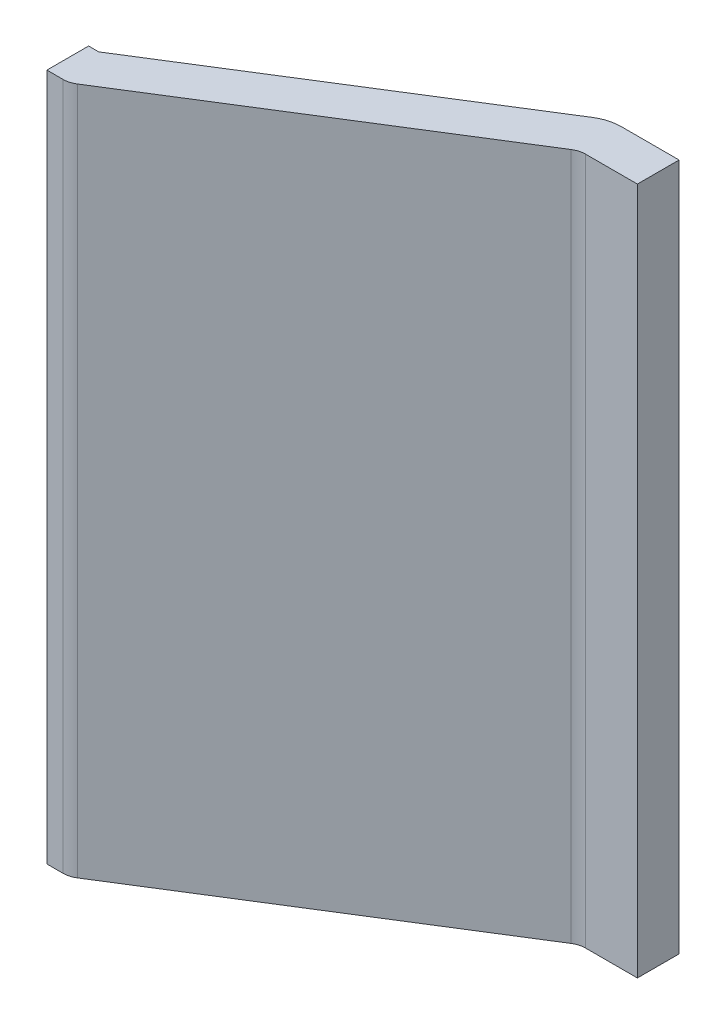
ISO-10303-21;
HEADER;
FILE_DESCRIPTION(('STEP AP214'),'2;1');
FILE_NAME('part.step','',(''),(''),'','','');
FILE_SCHEMA(('AUTOMOTIVE_DESIGN { 1 0 10303 214 1 1 1 1 }'));
ENDSEC;
DATA;
#1=APPLICATION_CONTEXT('core data for automotive mechanical design processes');
#2=APPLICATION_PROTOCOL_DEFINITION('international standard','automotive_design',2000,#1);
#3=PRODUCT_CONTEXT('',#1,'mechanical');
#4=PRODUCT('Part','Part','',(#3));
#5=PRODUCT_RELATED_PRODUCT_CATEGORY('part','',(#4));
#6=PRODUCT_DEFINITION_FORMATION('','',#4);
#7=PRODUCT_DEFINITION_CONTEXT('part definition',#1,'design');
#8=PRODUCT_DEFINITION('design','',#6,#7);
#9=PRODUCT_DEFINITION_SHAPE('','',#8);
#10=(LENGTH_UNIT() NAMED_UNIT(*) SI_UNIT(.MILLI.,.METRE.));
#11=(NAMED_UNIT(*) PLANE_ANGLE_UNIT() SI_UNIT($,.RADIAN.));
#12=(NAMED_UNIT(*) SI_UNIT($,.STERADIAN.) SOLID_ANGLE_UNIT());
#13=UNCERTAINTY_MEASURE_WITH_UNIT(LENGTH_MEASURE(1.E-05),#10,'distance_accuracy_value','');
#14=(GEOMETRIC_REPRESENTATION_CONTEXT(3) GLOBAL_UNCERTAINTY_ASSIGNED_CONTEXT((#13)) GLOBAL_UNIT_ASSIGNED_CONTEXT((#10,
#11,#12)) REPRESENTATION_CONTEXT('',''));
#15=CARTESIAN_POINT('',(0.,0.,0.));
#16=DIRECTION('',(0.,0.,1.));
#17=DIRECTION('',(1.,0.,0.));
#18=AXIS2_PLACEMENT_3D('',#15,#16,#17);
#19=CARTESIAN_POINT('',(1.824104576066,-1.525,0.964303036979));
#20=DIRECTION('',(0.,1.,0.));
#21=DIRECTION('',(0.530661276733133,0.,0.847583983671212));
#22=AXIS2_PLACEMENT_3D('',#19,#20,#21);
#23=CYLINDRICAL_SURFACE('',#22,0.0925);
#24=DIRECTION('',(0.,1.,0.));
#25=VECTOR('',#24,1.);
#26=CARTESIAN_POINT('',(1.873190744164,-1.525,1.042704555469));
#27=LINE('',#26,#25);
#28=CARTESIAN_POINT('',(1.873190744164,-1.525,1.042704555469));
#29=VERTEX_POINT('',#28);
#30=CARTESIAN_POINT('',(1.873190744164,1.525,1.042704555469));
#31=VERTEX_POINT('',#30);
#32=EDGE_CURVE('E26',#29,#31,#27,.T.);
#33=ORIENTED_EDGE('',*,*,#32,.T.);
#34=CARTESIAN_POINT('',(1.824104576066,1.525,0.964303036979));
#35=DIRECTION('',(0.,-1.,0.));
#36=DIRECTION('',(0.,0.,1.));
#37=AXIS2_PLACEMENT_3D('',#34,#35,#36);
#38=CIRCLE('',#37,0.0925);
#39=CARTESIAN_POINT('',(1.824104576066,1.525,1.056803036979));
#40=VERTEX_POINT('',#39);
#41=EDGE_CURVE('E176',#31,#40,#38,.T.);
#42=ORIENTED_EDGE('',*,*,#41,.T.);
#43=DIRECTION('',(0.,1.,0.));
#44=VECTOR('',#43,1.);
#45=CARTESIAN_POINT('',(1.824104576066,-1.525,1.056803036979));
#46=LINE('',#45,#44);
#47=CARTESIAN_POINT('',(1.824104576066,-1.525,1.056803036979));
#48=VERTEX_POINT('',#47);
#49=EDGE_CURVE('E11',#48,#40,#46,.T.);
#50=ORIENTED_EDGE('',*,*,#49,.F.);
#51=CARTESIAN_POINT('',(1.824104576066,-1.525,0.964303036979));
#52=DIRECTION('',(0.,-1.,0.));
#53=DIRECTION('',(0.,0.,1.));
#54=AXIS2_PLACEMENT_3D('',#51,#52,#53);
#55=CIRCLE('',#54,0.0925);
#56=EDGE_CURVE('E222',#29,#48,#55,.T.);
#57=ORIENTED_EDGE('',*,*,#56,.F.);
#58=EDGE_LOOP('',(#33,#42,#50,#57));
#59=FACE_BOUND('',#58,.T.);
#60=ADVANCED_FACE('F17',(#59),#23,.T.);
#61=CARTESIAN_POINT('',(1.7525,-1.525,1.056803036979));
#62=DIRECTION('',(0.,0.,1.));
#63=DIRECTION('',(1.,0.,0.));
#64=AXIS2_PLACEMENT_3D('',#61,#62,#63);
#65=PLANE('',#64);
#66=DIRECTION('',(1.,0.,0.));
#67=VECTOR('',#66,1.);
#68=CARTESIAN_POINT('',(1.7525,1.525,1.056803036979));
#69=LINE('',#68,#67);
#70=CARTESIAN_POINT('',(1.7525,1.525,1.056803036979));
#71=VERTEX_POINT('',#70);
#72=EDGE_CURVE('E172',#71,#40,#69,.T.);
#73=ORIENTED_EDGE('',*,*,#72,.F.);
#74=DIRECTION('',(0.,1.,0.));
#75=VECTOR('',#74,1.);
#76=CARTESIAN_POINT('',(1.7525,-1.525,1.056803036979));
#77=LINE('',#76,#75);
#78=CARTESIAN_POINT('',(1.7525,-1.525,1.056803036979));
#79=VERTEX_POINT('',#78);
#80=EDGE_CURVE('E203',#79,#71,#77,.T.);
#81=ORIENTED_EDGE('',*,*,#80,.F.);
#82=DIRECTION('',(1.,0.,0.));
#83=VECTOR('',#82,1.);
#84=CARTESIAN_POINT('',(1.7525,-1.525,1.056803036979));
#85=LINE('',#84,#83);
#86=EDGE_CURVE('E226',#79,#48,#85,.T.);
#87=ORIENTED_EDGE('',*,*,#86,.T.);
#88=ORIENTED_EDGE('',*,*,#49,.T.);
#89=EDGE_LOOP('',(#73,#81,#87,#88));
#90=FACE_BOUND('',#89,.T.);
#91=ADVANCED_FACE('F19',(#90),#65,.T.);
#92=CARTESIAN_POINT('',(3.288172336196,-1.525,0.156803036979));
#93=DIRECTION('',(0.530661276733133,0.,0.847583983671212));
#94=DIRECTION('',(0.,-1.,0.));
#95=AXIS2_PLACEMENT_3D('',#92,#93,#94);
#96=PLANE('',#95);
#97=DIRECTION('',(-0.847583983671212,0.,0.530661276733133));
#98=VECTOR('',#97,1.);
#99=CARTESIAN_POINT('',(3.288172336196,-1.525,0.156803036979));
#100=LINE('',#99,#98);
#101=CARTESIAN_POINT('',(3.220617112292,-1.525,0.19909848151));
#102=VERTEX_POINT('',#101);
#103=EDGE_CURVE('E218',#102,#29,#100,.T.);
#104=ORIENTED_EDGE('',*,*,#103,.F.);
#105=DIRECTION('',(0.,1.,0.));
#106=VECTOR('',#105,1.);
#107=CARTESIAN_POINT('',(3.220617112292,-1.525,0.19909848151));
#108=LINE('',#107,#106);
#109=CARTESIAN_POINT('',(3.220617112292,1.525,0.19909848151));
#110=VERTEX_POINT('',#109);
#111=EDGE_CURVE('E186',#102,#110,#108,.T.);
#112=ORIENTED_EDGE('',*,*,#111,.T.);
#113=DIRECTION('',(-0.847583983671212,0.,0.530661276733133));
#114=VECTOR('',#113,1.);
#115=CARTESIAN_POINT('',(3.288172336196,1.525,0.156803036979));
#116=LINE('',#115,#114);
#117=EDGE_CURVE('E204',#110,#31,#116,.T.);
#118=ORIENTED_EDGE('',*,*,#117,.T.);
#119=ORIENTED_EDGE('',*,*,#32,.F.);
#120=EDGE_LOOP('',(#104,#112,#118,#119));
#121=FACE_BOUND('',#120,.T.);
#122=ADVANCED_FACE('F255',(#121),#96,.T.);
#123=CARTESIAN_POINT('',(1.7525,-1.525,0.871803036979));
#124=DIRECTION('',(1.,0.,0.));
#125=DIRECTION('',(0.,1.,0.));
#126=AXIS2_PLACEMENT_3D('',#123,#124,#125);
#127=PLANE('',#126);
#128=DIRECTION('',(0.,0.,1.));
#129=VECTOR('',#128,1.);
#130=CARTESIAN_POINT('',(1.7525,-1.525,0.871803036979));
#131=LINE('',#130,#129);
#132=CARTESIAN_POINT('',(1.7525,-1.525,0.871803036979));
#133=VERTEX_POINT('',#132);
#134=EDGE_CURVE('E194',#133,#79,#131,.T.);
#135=ORIENTED_EDGE('',*,*,#134,.T.);
#136=ORIENTED_EDGE('',*,*,#80,.T.);
#137=DIRECTION('',(0.,0.,1.));
#138=VECTOR('',#137,1.);
#139=CARTESIAN_POINT('',(1.7525,1.525,0.871803036979));
#140=LINE('',#139,#138);
#141=CARTESIAN_POINT('',(1.7525,1.525,0.871803036979));
#142=VERTEX_POINT('',#141);
#143=EDGE_CURVE('E177',#142,#71,#140,.T.);
#144=ORIENTED_EDGE('',*,*,#143,.F.);
#145=DIRECTION('',(0.,1.,0.));
#146=VECTOR('',#145,1.);
#147=CARTESIAN_POINT('',(1.7525,-1.525,0.871803036979));
#148=LINE('',#147,#146);
#149=EDGE_CURVE('E200',#133,#142,#148,.T.);
#150=ORIENTED_EDGE('',*,*,#149,.F.);
#151=EDGE_LOOP('',(#135,#136,#144,#150));
#152=FACE_BOUND('',#151,.T.);
#153=ADVANCED_FACE('F276',(#152),#127,.F.);
#154=CARTESIAN_POINT('',(1.7525,-1.525,0.871803036979));
#155=DIRECTION('',(0.,0.,1.));
#156=DIRECTION('',(1.,0.,0.));
#157=AXIS2_PLACEMENT_3D('',#154,#155,#156);
#158=PLANE('',#157);
#159=DIRECTION('',(0.,1.,0.));
#160=VECTOR('',#159,1.);
#161=CARTESIAN_POINT('',(1.797536815936,-1.525,0.871803036979));
#162=LINE('',#161,#160);
#163=CARTESIAN_POINT('',(1.797536815936,-1.525,0.871803036979));
#164=VERTEX_POINT('',#163);
#165=CARTESIAN_POINT('',(1.797536815936,1.525,0.871803036979));
#166=VERTEX_POINT('',#165);
#167=EDGE_CURVE('E48',#164,#166,#162,.T.);
#168=ORIENTED_EDGE('',*,*,#167,.F.);
#169=DIRECTION('',(1.,0.,0.));
#170=VECTOR('',#169,1.);
#171=CARTESIAN_POINT('',(1.7525,-1.525,0.871803036979));
#172=LINE('',#171,#170);
#173=EDGE_CURVE('E189',#133,#164,#172,.T.);
#174=ORIENTED_EDGE('',*,*,#173,.F.);
#175=ORIENTED_EDGE('',*,*,#149,.T.);
#176=DIRECTION('',(1.,0.,0.));
#177=VECTOR('',#176,1.);
#178=CARTESIAN_POINT('',(1.7525,1.525,0.871803036979));
#179=LINE('',#178,#177);
#180=EDGE_CURVE('E185',#142,#166,#179,.T.);
#181=ORIENTED_EDGE('',*,*,#180,.T.);
#182=EDGE_LOOP('',(#168,#174,#175,#181));
#183=FACE_BOUND('',#182,.T.);
#184=ADVANCED_FACE('F278',(#183),#158,.F.);
#185=CARTESIAN_POINT('',(3.19,-1.525,0.));
#186=DIRECTION('',(0.530661276733133,0.,0.847583983671212));
#187=DIRECTION('',(0.,-1.,0.));
#188=AXIS2_PLACEMENT_3D('',#185,#186,#187);
#189=PLANE('',#188);
#190=ORIENTED_EDGE('',*,*,#167,.T.);
#191=DIRECTION('',(-0.847583983671212,0.,0.530661276733133));
#192=VECTOR('',#191,1.);
#193=CARTESIAN_POINT('',(3.19,1.525,0.));
#194=LINE('',#193,#192);
#195=CARTESIAN_POINT('',(3.144963184064,1.525,0.02819696302084));
#196=VERTEX_POINT('',#195);
#197=EDGE_CURVE('E181',#196,#166,#194,.T.);
#198=ORIENTED_EDGE('',*,*,#197,.F.);
#199=DIRECTION('',(0.,1.,0.));
#200=VECTOR('',#199,1.);
#201=CARTESIAN_POINT('',(3.144963184064,-1.525,0.02819696302084));
#202=LINE('',#201,#200);
#203=CARTESIAN_POINT('',(3.144963184064,-1.525,0.02819696302084));
#204=VERTEX_POINT('',#203);
#205=EDGE_CURVE('E38',#204,#196,#202,.T.);
#206=ORIENTED_EDGE('',*,*,#205,.F.);
#207=DIRECTION('',(-0.847583983671212,0.,0.530661276733133));
#208=VECTOR('',#207,1.);
#209=CARTESIAN_POINT('',(3.19,-1.525,0.));
#210=LINE('',#209,#208);
#211=EDGE_CURVE('E193',#204,#164,#210,.T.);
#212=ORIENTED_EDGE('',*,*,#211,.T.);
#213=EDGE_LOOP('',(#190,#198,#206,#212));
#214=FACE_BOUND('',#213,.T.);
#215=ADVANCED_FACE('F280',(#214),#189,.F.);
#216=CARTESIAN_POINT('',(3.24313552026,-1.525,0.185));
#217=DIRECTION('',(0.,1.,0.));
#218=DIRECTION('',(0.,0.,-1.));
#219=AXIS2_PLACEMENT_3D('',#216,#217,#218);
#220=CYLINDRICAL_SURFACE('',#219,0.185);
#221=CARTESIAN_POINT('',(3.24313552026,-1.525,0.185));
#222=DIRECTION('',(0.,1.,0.));
#223=DIRECTION('',(0.,0.,1.));
#224=AXIS2_PLACEMENT_3D('',#221,#222,#223);
#225=CIRCLE('',#224,0.185);
#226=CARTESIAN_POINT('',(3.24313552026,-1.525,0.));
#227=VERTEX_POINT('',#226);
#228=EDGE_CURVE('E235',#227,#204,#225,.T.);
#229=ORIENTED_EDGE('',*,*,#228,.T.);
#230=ORIENTED_EDGE('',*,*,#205,.T.);
#231=CARTESIAN_POINT('',(3.24313552026,1.525,0.185));
#232=DIRECTION('',(0.,1.,0.));
#233=DIRECTION('',(0.,0.,1.));
#234=AXIS2_PLACEMENT_3D('',#231,#232,#233);
#235=CIRCLE('',#234,0.185);
#236=CARTESIAN_POINT('',(3.24313552026,1.525,0.));
#237=VERTEX_POINT('',#236);
#238=EDGE_CURVE('E169',#237,#196,#235,.T.);
#239=ORIENTED_EDGE('',*,*,#238,.F.);
#240=DIRECTION('',(0.,1.,0.));
#241=VECTOR('',#240,1.);
#242=CARTESIAN_POINT('',(3.24313552026,-1.525,0.));
#243=LINE('',#242,#241);
#244=EDGE_CURVE('E238',#227,#237,#243,.T.);
#245=ORIENTED_EDGE('',*,*,#244,.F.);
#246=EDGE_LOOP('',(#229,#230,#239,#245));
#247=FACE_BOUND('',#246,.T.);
#248=ADVANCED_FACE('F431',(#247),#220,.T.);
#249=CARTESIAN_POINT('',(3.19,-1.525,0.));
#250=DIRECTION('',(0.,0.,1.));
#251=DIRECTION('',(1.,0.,0.));
#252=AXIS2_PLACEMENT_3D('',#249,#250,#251);
#253=PLANE('',#252);
#254=ORIENTED_EDGE('',*,*,#244,.T.);
#255=DIRECTION('',(1.,0.,0.));
#256=VECTOR('',#255,1.);
#257=CARTESIAN_POINT('',(3.19,1.525,0.));
#258=LINE('',#257,#256);
#259=CARTESIAN_POINT('',(3.5,1.525,0.));
#260=VERTEX_POINT('',#259);
#261=EDGE_CURVE('E154',#237,#260,#258,.T.);
#262=ORIENTED_EDGE('',*,*,#261,.T.);
#263=DIRECTION('',(0.,1.,0.));
#264=VECTOR('',#263,1.);
#265=CARTESIAN_POINT('',(3.5,-1.525,0.));
#266=LINE('',#265,#264);
#267=CARTESIAN_POINT('',(3.5,-1.525,0.));
#268=VERTEX_POINT('',#267);
#269=EDGE_CURVE('E142',#268,#260,#266,.T.);
#270=ORIENTED_EDGE('',*,*,#269,.F.);
#271=DIRECTION('',(1.,0.,0.));
#272=VECTOR('',#271,1.);
#273=CARTESIAN_POINT('',(3.19,-1.525,0.));
#274=LINE('',#273,#272);
#275=EDGE_CURVE('E138',#227,#268,#274,.T.);
#276=ORIENTED_EDGE('',*,*,#275,.F.);
#277=EDGE_LOOP('',(#254,#262,#270,#276));
#278=FACE_BOUND('',#277,.T.);
#279=ADVANCED_FACE('F423',(#278),#253,.F.);
#280=CARTESIAN_POINT('',(2.614100714426,-1.525,0.486101794686));
#281=DIRECTION('',(0.,-1.,0.));
#282=DIRECTION('',(0.,0.,-1.));
#283=AXIS2_PLACEMENT_3D('',#280,#281,#282);
#284=PLANE('',#283);
#285=ORIENTED_EDGE('',*,*,#275,.T.);
#286=DIRECTION('',(0.,0.,1.));
#287=VECTOR('',#286,1.);
#288=CARTESIAN_POINT('',(3.5,-1.525,0.));
#289=LINE('',#288,#287);
#290=CARTESIAN_POINT('',(3.5,-1.525,0.185));
#291=VERTEX_POINT('',#290);
#292=EDGE_CURVE('E129',#268,#291,#289,.T.);
#293=ORIENTED_EDGE('',*,*,#292,.T.);
#294=DIRECTION('',(1.,0.,0.));
#295=VECTOR('',#294,1.);
#296=CARTESIAN_POINT('',(3.19,-1.525,0.185));
#297=LINE('',#296,#295);
#298=CARTESIAN_POINT('',(3.269703280389,-1.525,0.185));
#299=VERTEX_POINT('',#298);
#300=EDGE_CURVE('E134',#299,#291,#297,.T.);
#301=ORIENTED_EDGE('',*,*,#300,.F.);
#302=CARTESIAN_POINT('',(3.269703280389,-1.525,0.2775));
#303=DIRECTION('',(0.,1.,0.));
#304=DIRECTION('',(0.,0.,1.));
#305=AXIS2_PLACEMENT_3D('',#302,#303,#304);
#306=CIRCLE('',#305,0.0925);
#307=EDGE_CURVE('E143',#299,#102,#306,.T.);
#308=ORIENTED_EDGE('',*,*,#307,.T.);
#309=ORIENTED_EDGE('',*,*,#103,.T.);
#310=ORIENTED_EDGE('',*,*,#56,.T.);
#311=ORIENTED_EDGE('',*,*,#86,.F.);
#312=ORIENTED_EDGE('',*,*,#134,.F.);
#313=ORIENTED_EDGE('',*,*,#173,.T.);
#314=ORIENTED_EDGE('',*,*,#211,.F.);
#315=ORIENTED_EDGE('',*,*,#228,.F.);
#316=EDGE_LOOP('',(#285,#293,#301,#308,#309,#310,#311,#312,#313,#314,#315));
#317=FACE_BOUND('',#316,.T.);
#318=ADVANCED_FACE('F131',(#317),#284,.T.);
#319=CARTESIAN_POINT('',(3.5,-1.525,0.));
#320=DIRECTION('',(1.,0.,0.));
#321=DIRECTION('',(0.,1.,0.));
#322=AXIS2_PLACEMENT_3D('',#319,#320,#321);
#323=PLANE('',#322);
#324=ORIENTED_EDGE('',*,*,#292,.F.);
#325=ORIENTED_EDGE('',*,*,#269,.T.);
#326=DIRECTION('',(0.,0.,1.));
#327=VECTOR('',#326,1.);
#328=CARTESIAN_POINT('',(3.5,1.525,0.));
#329=LINE('',#328,#327);
#330=CARTESIAN_POINT('',(3.5,1.525,0.185));
#331=VERTEX_POINT('',#330);
#332=EDGE_CURVE('E149',#260,#331,#329,.T.);
#333=ORIENTED_EDGE('',*,*,#332,.T.);
#334=DIRECTION('',(0.,1.,0.));
#335=VECTOR('',#334,1.);
#336=CARTESIAN_POINT('',(3.5,-1.525,0.185));
#337=LINE('',#336,#335);
#338=EDGE_CURVE('E146',#291,#331,#337,.T.);
#339=ORIENTED_EDGE('',*,*,#338,.F.);
#340=EDGE_LOOP('',(#324,#325,#333,#339));
#341=FACE_BOUND('',#340,.T.);
#342=ADVANCED_FACE('F147',(#341),#323,.T.);
#343=CARTESIAN_POINT('',(3.269703280389,-1.525,0.2775));
#344=DIRECTION('',(0.,1.,0.));
#345=DIRECTION('',(0.,0.,-1.));
#346=AXIS2_PLACEMENT_3D('',#343,#344,#345);
#347=CYLINDRICAL_SURFACE('',#346,0.0925);
#348=DIRECTION('',(0.,1.,0.));
#349=VECTOR('',#348,1.);
#350=CARTESIAN_POINT('',(3.269703280389,-1.525,0.185));
#351=LINE('',#350,#349);
#352=CARTESIAN_POINT('',(3.269703280389,1.525,0.185));
#353=VERTEX_POINT('',#352);
#354=EDGE_CURVE('E158',#299,#353,#351,.T.);
#355=ORIENTED_EDGE('',*,*,#354,.T.);
#356=CARTESIAN_POINT('',(3.269703280389,1.525,0.2775));
#357=DIRECTION('',(0.,1.,0.));
#358=DIRECTION('',(0.,0.,1.));
#359=AXIS2_PLACEMENT_3D('',#356,#357,#358);
#360=CIRCLE('',#359,0.0925);
#361=EDGE_CURVE('E208',#353,#110,#360,.T.);
#362=ORIENTED_EDGE('',*,*,#361,.T.);
#363=ORIENTED_EDGE('',*,*,#111,.F.);
#364=ORIENTED_EDGE('',*,*,#307,.F.);
#365=EDGE_LOOP('',(#355,#362,#363,#364));
#366=FACE_BOUND('',#365,.T.);
#367=ADVANCED_FACE('F270',(#366),#347,.F.);
#368=CARTESIAN_POINT('',(2.614100714426,1.525,0.486101794686));
#369=DIRECTION('',(0.,1.,0.));
#370=DIRECTION('',(0.,0.,-1.));
#371=AXIS2_PLACEMENT_3D('',#368,#369,#370);
#372=PLANE('',#371);
#373=ORIENTED_EDGE('',*,*,#261,.F.);
#374=ORIENTED_EDGE('',*,*,#238,.T.);
#375=ORIENTED_EDGE('',*,*,#197,.T.);
#376=ORIENTED_EDGE('',*,*,#180,.F.);
#377=ORIENTED_EDGE('',*,*,#143,.T.);
#378=ORIENTED_EDGE('',*,*,#72,.T.);
#379=ORIENTED_EDGE('',*,*,#41,.F.);
#380=ORIENTED_EDGE('',*,*,#117,.F.);
#381=ORIENTED_EDGE('',*,*,#361,.F.);
#382=DIRECTION('',(1.,0.,0.));
#383=VECTOR('',#382,1.);
#384=CARTESIAN_POINT('',(3.19,1.525,0.185));
#385=LINE('',#384,#383);
#386=EDGE_CURVE('E165',#353,#331,#385,.T.);
#387=ORIENTED_EDGE('',*,*,#386,.T.);
#388=ORIENTED_EDGE('',*,*,#332,.F.);
#389=EDGE_LOOP('',(#373,#374,#375,#376,#377,#378,#379,#380,#381,#387,#388));
#390=FACE_BOUND('',#389,.T.);
#391=ADVANCED_FACE('F259',(#390),#372,.T.);
#392=CARTESIAN_POINT('',(3.19,-1.525,0.185));
#393=DIRECTION('',(0.,0.,1.));
#394=DIRECTION('',(1.,0.,0.));
#395=AXIS2_PLACEMENT_3D('',#392,#393,#394);
#396=PLANE('',#395);
#397=ORIENTED_EDGE('',*,*,#386,.F.);
#398=ORIENTED_EDGE('',*,*,#354,.F.);
#399=ORIENTED_EDGE('',*,*,#300,.T.);
#400=ORIENTED_EDGE('',*,*,#338,.T.);
#401=EDGE_LOOP('',(#397,#398,#399,#400));
#402=FACE_BOUND('',#401,.T.);
#403=ADVANCED_FACE('F156',(#402),#396,.T.);
#404=CLOSED_SHELL('',(#60,#91,#122,#153,#184,#215,#248,#279,#318,#342,#367,#391,#403));
#405=MANIFOLD_SOLID_BREP('B1',#404);
#406=ADVANCED_BREP_SHAPE_REPRESENTATION('',(#18,#405),#14);
#407=SHAPE_DEFINITION_REPRESENTATION(#9,#406);
ENDSEC;
END-ISO-10303-21;
